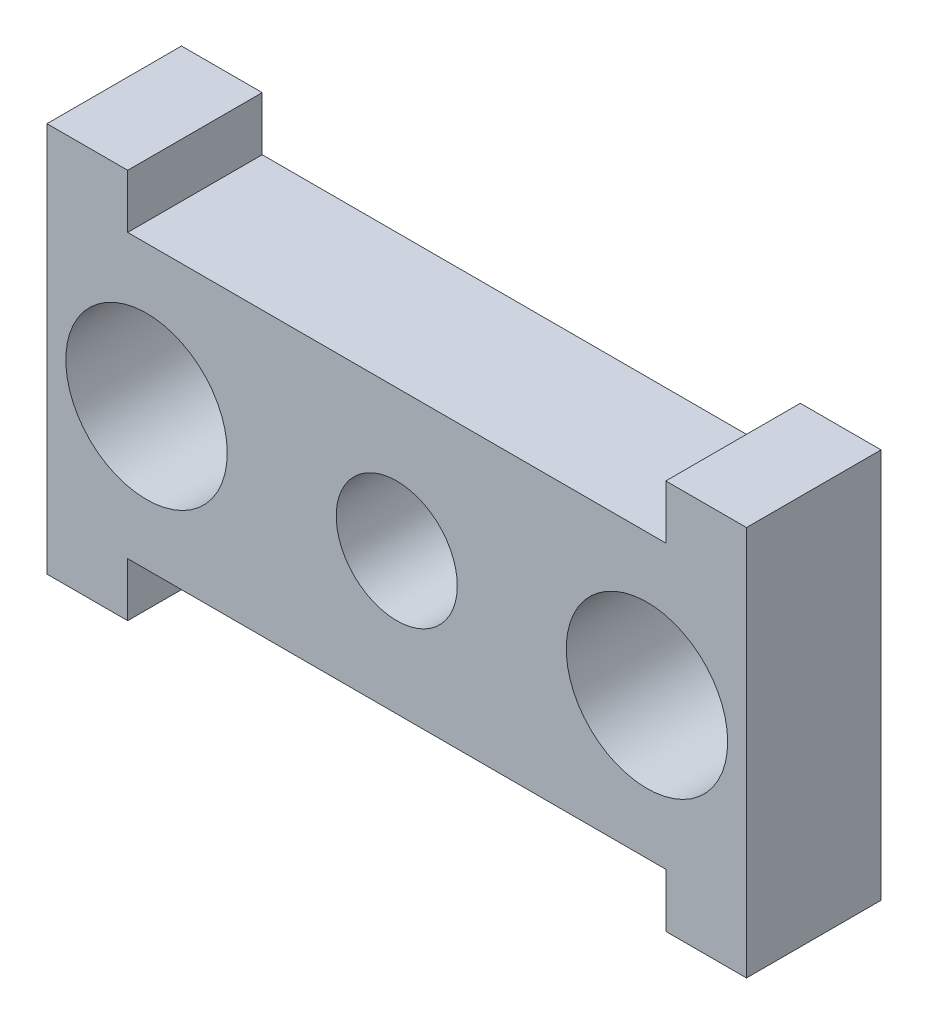
ISO-10303-21;
HEADER;
FILE_DESCRIPTION(('STEP AP214'),'2;1');
FILE_NAME('part.step','',(''),(''),'','','');
FILE_SCHEMA(('AUTOMOTIVE_DESIGN { 1 0 10303 214 1 1 1 1 }'));
ENDSEC;
DATA;
#1=APPLICATION_CONTEXT('core data for automotive mechanical design processes');
#2=APPLICATION_PROTOCOL_DEFINITION('international standard','automotive_design',2000,#1);
#3=PRODUCT_CONTEXT('',#1,'mechanical');
#4=PRODUCT('Part','Part','',(#3));
#5=PRODUCT_RELATED_PRODUCT_CATEGORY('part','',(#4));
#6=PRODUCT_DEFINITION_FORMATION('','',#4);
#7=PRODUCT_DEFINITION_CONTEXT('part definition',#1,'design');
#8=PRODUCT_DEFINITION('design','',#6,#7);
#9=PRODUCT_DEFINITION_SHAPE('','',#8);
#10=(LENGTH_UNIT() NAMED_UNIT(*) SI_UNIT(.MILLI.,.METRE.));
#11=(NAMED_UNIT(*) PLANE_ANGLE_UNIT() SI_UNIT($,.RADIAN.));
#12=(NAMED_UNIT(*) SI_UNIT($,.STERADIAN.) SOLID_ANGLE_UNIT());
#13=UNCERTAINTY_MEASURE_WITH_UNIT(LENGTH_MEASURE(1.E-05),#10,'distance_accuracy_value','');
#14=(GEOMETRIC_REPRESENTATION_CONTEXT(3) GLOBAL_UNCERTAINTY_ASSIGNED_CONTEXT((#13)) GLOBAL_UNIT_ASSIGNED_CONTEXT((#10,
#11,#12)) REPRESENTATION_CONTEXT('',''));
#15=CARTESIAN_POINT('',(0.,0.,0.));
#16=DIRECTION('',(0.,0.,1.));
#17=DIRECTION('',(1.,0.,0.));
#18=AXIS2_PLACEMENT_3D('',#15,#16,#17);
#19=CARTESIAN_POINT('',(-9.99999999999999,0.,5.));
#20=DIRECTION('',(-1.,0.,0.));
#21=DIRECTION('',(0.,-1.,0.));
#22=AXIS2_PLACEMENT_3D('',#19,#20,#21);
#23=PLANE('',#22);
#24=DIRECTION('',(0.,1.,0.));
#25=VECTOR('',#24,1.);
#26=CARTESIAN_POINT('',(-9.99999999999999,0.,0.));
#27=LINE('',#26,#25);
#28=CARTESIAN_POINT('',(-10.,-7.25000000000001,0.));
#29=VERTEX_POINT('',#28);
#30=CARTESIAN_POINT('',(-10.,-5.25,0.));
#31=VERTEX_POINT('',#30);
#32=EDGE_CURVE('E167',#29,#31,#27,.T.);
#33=ORIENTED_EDGE('',*,*,#32,.T.);
#34=DIRECTION('',(0.,0.,-1.));
#35=VECTOR('',#34,1.);
#36=CARTESIAN_POINT('',(-10.,-5.25,5.));
#37=LINE('',#36,#35);
#38=CARTESIAN_POINT('',(-10.,-5.25,5.));
#39=VERTEX_POINT('',#38);
#40=EDGE_CURVE('E11',#39,#31,#37,.T.);
#41=ORIENTED_EDGE('',*,*,#40,.F.);
#42=DIRECTION('',(0.,1.,0.));
#43=VECTOR('',#42,1.);
#44=CARTESIAN_POINT('',(-9.99999999999999,0.,5.));
#45=LINE('',#44,#43);
#46=CARTESIAN_POINT('',(-10.,-7.25000000000001,5.));
#47=VERTEX_POINT('',#46);
#48=EDGE_CURVE('E202',#47,#39,#45,.T.);
#49=ORIENTED_EDGE('',*,*,#48,.F.);
#50=DIRECTION('',(0.,0.,-1.));
#51=VECTOR('',#50,1.);
#52=CARTESIAN_POINT('',(-10.,-7.25000000000001,5.));
#53=LINE('',#52,#51);
#54=EDGE_CURVE('E166',#47,#29,#53,.T.);
#55=ORIENTED_EDGE('',*,*,#54,.T.);
#56=EDGE_LOOP('',(#33,#41,#49,#55));
#57=FACE_BOUND('',#56,.T.);
#58=ADVANCED_FACE('F35',(#57),#23,.F.);
#59=CARTESIAN_POINT('',(0.,-5.25,5.));
#60=DIRECTION('',(0.,1.,0.));
#61=DIRECTION('',(-1.,0.,0.));
#62=AXIS2_PLACEMENT_3D('',#59,#60,#61);
#63=PLANE('',#62);
#64=DIRECTION('',(1.,0.,0.));
#65=VECTOR('',#64,1.);
#66=CARTESIAN_POINT('',(0.,-5.25,0.));
#67=LINE('',#66,#65);
#68=CARTESIAN_POINT('',(10.,-5.25,0.));
#69=VERTEX_POINT('',#68);
#70=EDGE_CURVE('E170',#31,#69,#67,.T.);
#71=ORIENTED_EDGE('',*,*,#70,.T.);
#72=DIRECTION('',(0.,0.,-1.));
#73=VECTOR('',#72,1.);
#74=CARTESIAN_POINT('',(10.,-5.25,5.));
#75=LINE('',#74,#73);
#76=CARTESIAN_POINT('',(10.,-5.25,5.));
#77=VERTEX_POINT('',#76);
#78=EDGE_CURVE('E43',#77,#69,#75,.T.);
#79=ORIENTED_EDGE('',*,*,#78,.F.);
#80=DIRECTION('',(1.,0.,0.));
#81=VECTOR('',#80,1.);
#82=CARTESIAN_POINT('',(0.,-5.25,5.));
#83=LINE('',#82,#81);
#84=EDGE_CURVE('E102',#39,#77,#83,.T.);
#85=ORIENTED_EDGE('',*,*,#84,.F.);
#86=ORIENTED_EDGE('',*,*,#40,.T.);
#87=EDGE_LOOP('',(#71,#79,#85,#86));
#88=FACE_BOUND('',#87,.T.);
#89=ADVANCED_FACE('F275',(#88),#63,.F.);
#90=CARTESIAN_POINT('',(9.99999999999998,0.,5.));
#91=DIRECTION('',(1.,0.,0.));
#92=DIRECTION('',(0.,1.,0.));
#93=AXIS2_PLACEMENT_3D('',#90,#91,#92);
#94=PLANE('',#93);
#95=DIRECTION('',(0.,-1.,0.));
#96=VECTOR('',#95,1.);
#97=CARTESIAN_POINT('',(9.99999999999998,0.,0.));
#98=LINE('',#97,#96);
#99=CARTESIAN_POINT('',(10.,-7.25,0.));
#100=VERTEX_POINT('',#99);
#101=EDGE_CURVE('E172',#69,#100,#98,.T.);
#102=ORIENTED_EDGE('',*,*,#101,.T.);
#103=DIRECTION('',(0.,0.,-1.));
#104=VECTOR('',#103,1.);
#105=CARTESIAN_POINT('',(10.,-7.25,5.));
#106=LINE('',#105,#104);
#107=CARTESIAN_POINT('',(10.,-7.25,5.));
#108=VERTEX_POINT('',#107);
#109=EDGE_CURVE('E217',#108,#100,#106,.T.);
#110=ORIENTED_EDGE('',*,*,#109,.F.);
#111=DIRECTION('',(0.,-1.,0.));
#112=VECTOR('',#111,1.);
#113=CARTESIAN_POINT('',(9.99999999999998,0.,5.));
#114=LINE('',#113,#112);
#115=EDGE_CURVE('E225',#77,#108,#114,.T.);
#116=ORIENTED_EDGE('',*,*,#115,.F.);
#117=ORIENTED_EDGE('',*,*,#78,.T.);
#118=EDGE_LOOP('',(#102,#110,#116,#117));
#119=FACE_BOUND('',#118,.T.);
#120=ADVANCED_FACE('F223',(#119),#94,.F.);
#121=CARTESIAN_POINT('',(0.,-7.25,5.));
#122=DIRECTION('',(0.,1.,0.));
#123=DIRECTION('',(-1.,0.,0.));
#124=AXIS2_PLACEMENT_3D('',#121,#122,#123);
#125=PLANE('',#124);
#126=DIRECTION('',(1.,0.,0.));
#127=VECTOR('',#126,1.);
#128=CARTESIAN_POINT('',(0.,-7.25,0.));
#129=LINE('',#128,#127);
#130=CARTESIAN_POINT('',(13.,-7.25,0.));
#131=VERTEX_POINT('',#130);
#132=EDGE_CURVE('E174',#100,#131,#129,.T.);
#133=ORIENTED_EDGE('',*,*,#132,.T.);
#134=DIRECTION('',(0.,0.,-1.));
#135=VECTOR('',#134,1.);
#136=CARTESIAN_POINT('',(13.,-7.25,5.));
#137=LINE('',#136,#135);
#138=CARTESIAN_POINT('',(13.,-7.25,5.));
#139=VERTEX_POINT('',#138);
#140=EDGE_CURVE('E214',#139,#131,#137,.T.);
#141=ORIENTED_EDGE('',*,*,#140,.F.);
#142=DIRECTION('',(1.,0.,0.));
#143=VECTOR('',#142,1.);
#144=CARTESIAN_POINT('',(0.,-7.25,5.));
#145=LINE('',#144,#143);
#146=EDGE_CURVE('E154',#108,#139,#145,.T.);
#147=ORIENTED_EDGE('',*,*,#146,.F.);
#148=ORIENTED_EDGE('',*,*,#109,.T.);
#149=EDGE_LOOP('',(#133,#141,#147,#148));
#150=FACE_BOUND('',#149,.T.);
#151=ADVANCED_FACE('F234',(#150),#125,.F.);
#152=CARTESIAN_POINT('',(13.,0.,5.));
#153=DIRECTION('',(-1.,0.,0.));
#154=DIRECTION('',(0.,-1.,0.));
#155=AXIS2_PLACEMENT_3D('',#152,#153,#154);
#156=PLANE('',#155);
#157=DIRECTION('',(0.,1.,0.));
#158=VECTOR('',#157,1.);
#159=CARTESIAN_POINT('',(13.,0.,0.));
#160=LINE('',#159,#158);
#161=CARTESIAN_POINT('',(13.,7.25000000000001,0.));
#162=VERTEX_POINT('',#161);
#163=EDGE_CURVE('E176',#131,#162,#160,.T.);
#164=ORIENTED_EDGE('',*,*,#163,.T.);
#165=DIRECTION('',(0.,0.,-1.));
#166=VECTOR('',#165,1.);
#167=CARTESIAN_POINT('',(13.,7.25000000000001,5.));
#168=LINE('',#167,#166);
#169=CARTESIAN_POINT('',(13.,7.25000000000001,5.));
#170=VERTEX_POINT('',#169);
#171=EDGE_CURVE('E212',#170,#162,#168,.T.);
#172=ORIENTED_EDGE('',*,*,#171,.F.);
#173=DIRECTION('',(0.,1.,0.));
#174=VECTOR('',#173,1.);
#175=CARTESIAN_POINT('',(13.,0.,5.));
#176=LINE('',#175,#174);
#177=EDGE_CURVE('E240',#139,#170,#176,.T.);
#178=ORIENTED_EDGE('',*,*,#177,.F.);
#179=ORIENTED_EDGE('',*,*,#140,.T.);
#180=EDGE_LOOP('',(#164,#172,#178,#179));
#181=FACE_BOUND('',#180,.T.);
#182=ADVANCED_FACE('F238',(#181),#156,.F.);
#183=CARTESIAN_POINT('',(0.,7.25,5.));
#184=DIRECTION('',(0.,1.,0.));
#185=DIRECTION('',(-1.,0.,0.));
#186=AXIS2_PLACEMENT_3D('',#183,#184,#185);
#187=PLANE('',#186);
#188=DIRECTION('',(1.,0.,0.));
#189=VECTOR('',#188,1.);
#190=CARTESIAN_POINT('',(0.,7.25,0.));
#191=LINE('',#190,#189);
#192=CARTESIAN_POINT('',(10.,7.25000000000001,0.));
#193=VERTEX_POINT('',#192);
#194=EDGE_CURVE('E179',#193,#162,#191,.T.);
#195=ORIENTED_EDGE('',*,*,#194,.F.);
#196=DIRECTION('',(0.,0.,-1.));
#197=VECTOR('',#196,1.);
#198=CARTESIAN_POINT('',(10.,7.25000000000001,5.));
#199=LINE('',#198,#197);
#200=CARTESIAN_POINT('',(10.,7.25000000000001,5.));
#201=VERTEX_POINT('',#200);
#202=EDGE_CURVE('E210',#201,#193,#199,.T.);
#203=ORIENTED_EDGE('',*,*,#202,.F.);
#204=DIRECTION('',(1.,0.,0.));
#205=VECTOR('',#204,1.);
#206=CARTESIAN_POINT('',(0.,7.25,5.));
#207=LINE('',#206,#205);
#208=EDGE_CURVE('E149',#201,#170,#207,.T.);
#209=ORIENTED_EDGE('',*,*,#208,.T.);
#210=ORIENTED_EDGE('',*,*,#171,.T.);
#211=EDGE_LOOP('',(#195,#203,#209,#210));
#212=FACE_BOUND('',#211,.T.);
#213=ADVANCED_FACE('F286',(#212),#187,.T.);
#214=CARTESIAN_POINT('',(10.,0.,5.));
#215=DIRECTION('',(-1.,0.,0.));
#216=DIRECTION('',(0.,0.,1.));
#217=AXIS2_PLACEMENT_3D('',#214,#215,#216);
#218=PLANE('',#217);
#219=DIRECTION('',(0.,1.,0.));
#220=VECTOR('',#219,1.);
#221=CARTESIAN_POINT('',(10.,0.,0.));
#222=LINE('',#221,#220);
#223=CARTESIAN_POINT('',(10.,5.25,0.));
#224=VERTEX_POINT('',#223);
#225=EDGE_CURVE('E182',#224,#193,#222,.T.);
#226=ORIENTED_EDGE('',*,*,#225,.F.);
#227=DIRECTION('',(0.,0.,-1.));
#228=VECTOR('',#227,1.);
#229=CARTESIAN_POINT('',(10.,5.25,5.));
#230=LINE('',#229,#228);
#231=CARTESIAN_POINT('',(10.,5.25,5.));
#232=VERTEX_POINT('',#231);
#233=EDGE_CURVE('E208',#232,#224,#230,.T.);
#234=ORIENTED_EDGE('',*,*,#233,.F.);
#235=DIRECTION('',(0.,1.,0.));
#236=VECTOR('',#235,1.);
#237=CARTESIAN_POINT('',(10.,0.,5.));
#238=LINE('',#237,#236);
#239=EDGE_CURVE('E244',#232,#201,#238,.T.);
#240=ORIENTED_EDGE('',*,*,#239,.T.);
#241=ORIENTED_EDGE('',*,*,#202,.T.);
#242=EDGE_LOOP('',(#226,#234,#240,#241));
#243=FACE_BOUND('',#242,.T.);
#244=ADVANCED_FACE('F287',(#243),#218,.T.);
#245=CARTESIAN_POINT('',(0.,5.25,5.));
#246=DIRECTION('',(0.,1.,0.));
#247=DIRECTION('',(-1.,0.,0.));
#248=AXIS2_PLACEMENT_3D('',#245,#246,#247);
#249=PLANE('',#248);
#250=DIRECTION('',(1.,0.,0.));
#251=VECTOR('',#250,1.);
#252=CARTESIAN_POINT('',(0.,5.25,0.));
#253=LINE('',#252,#251);
#254=CARTESIAN_POINT('',(-10.,5.25,0.));
#255=VERTEX_POINT('',#254);
#256=EDGE_CURVE('E185',#255,#224,#253,.T.);
#257=ORIENTED_EDGE('',*,*,#256,.F.);
#258=DIRECTION('',(0.,0.,-1.));
#259=VECTOR('',#258,1.);
#260=CARTESIAN_POINT('',(-10.,5.25,5.));
#261=LINE('',#260,#259);
#262=CARTESIAN_POINT('',(-10.,5.25,5.));
#263=VERTEX_POINT('',#262);
#264=EDGE_CURVE('E206',#263,#255,#261,.T.);
#265=ORIENTED_EDGE('',*,*,#264,.F.);
#266=DIRECTION('',(1.,0.,0.));
#267=VECTOR('',#266,1.);
#268=CARTESIAN_POINT('',(0.,5.25,5.));
#269=LINE('',#268,#267);
#270=EDGE_CURVE('E248',#263,#232,#269,.T.);
#271=ORIENTED_EDGE('',*,*,#270,.T.);
#272=ORIENTED_EDGE('',*,*,#233,.T.);
#273=EDGE_LOOP('',(#257,#265,#271,#272));
#274=FACE_BOUND('',#273,.T.);
#275=ADVANCED_FACE('F290',(#274),#249,.T.);
#276=CARTESIAN_POINT('',(-9.99999999999999,0.,5.));
#277=DIRECTION('',(1.,0.,0.));
#278=DIRECTION('',(0.,1.,0.));
#279=AXIS2_PLACEMENT_3D('',#276,#277,#278);
#280=PLANE('',#279);
#281=DIRECTION('',(0.,-1.,0.));
#282=VECTOR('',#281,1.);
#283=CARTESIAN_POINT('',(-9.99999999999999,0.,0.));
#284=LINE('',#283,#282);
#285=CARTESIAN_POINT('',(-10.,7.25,0.));
#286=VERTEX_POINT('',#285);
#287=EDGE_CURVE('E188',#286,#255,#284,.T.);
#288=ORIENTED_EDGE('',*,*,#287,.F.);
#289=DIRECTION('',(0.,0.,-1.));
#290=VECTOR('',#289,1.);
#291=CARTESIAN_POINT('',(-10.,7.25,5.));
#292=LINE('',#291,#290);
#293=CARTESIAN_POINT('',(-10.,7.25,5.));
#294=VERTEX_POINT('',#293);
#295=EDGE_CURVE('E139',#294,#286,#292,.T.);
#296=ORIENTED_EDGE('',*,*,#295,.F.);
#297=DIRECTION('',(0.,-1.,0.));
#298=VECTOR('',#297,1.);
#299=CARTESIAN_POINT('',(-9.99999999999999,0.,5.));
#300=LINE('',#299,#298);
#301=EDGE_CURVE('E147',#294,#263,#300,.T.);
#302=ORIENTED_EDGE('',*,*,#301,.T.);
#303=ORIENTED_EDGE('',*,*,#264,.T.);
#304=EDGE_LOOP('',(#288,#296,#302,#303));
#305=FACE_BOUND('',#304,.T.);
#306=ADVANCED_FACE('F253',(#305),#280,.T.);
#307=CARTESIAN_POINT('',(-13.,7.25,0.));
#308=VERTEX_POINT('',#307);
#309=EDGE_CURVE('E134',#308,#286,#191,.T.);
#310=ORIENTED_EDGE('',*,*,#309,.F.);
#311=DIRECTION('',(0.,0.,-1.));
#312=VECTOR('',#311,1.);
#313=CARTESIAN_POINT('',(-13.,7.25,5.));
#314=LINE('',#313,#312);
#315=CARTESIAN_POINT('',(-13.,7.25,5.));
#316=VERTEX_POINT('',#315);
#317=EDGE_CURVE('E129',#316,#308,#314,.T.);
#318=ORIENTED_EDGE('',*,*,#317,.F.);
#319=EDGE_CURVE('E132',#316,#294,#207,.T.);
#320=ORIENTED_EDGE('',*,*,#319,.T.);
#321=ORIENTED_EDGE('',*,*,#295,.T.);
#322=EDGE_LOOP('',(#310,#318,#320,#321));
#323=FACE_BOUND('',#322,.T.);
#324=ADVANCED_FACE('F131',(#323),#187,.T.);
#325=CARTESIAN_POINT('',(-13.,0.,5.));
#326=DIRECTION('',(-1.,0.,0.));
#327=DIRECTION('',(0.,0.,1.));
#328=AXIS2_PLACEMENT_3D('',#325,#326,#327);
#329=PLANE('',#328);
#330=DIRECTION('',(0.,1.,0.));
#331=VECTOR('',#330,1.);
#332=CARTESIAN_POINT('',(-13.,0.,0.));
#333=LINE('',#332,#331);
#334=CARTESIAN_POINT('',(-13.,-7.25000000000001,0.));
#335=VERTEX_POINT('',#334);
#336=EDGE_CURVE('E191',#335,#308,#333,.T.);
#337=ORIENTED_EDGE('',*,*,#336,.F.);
#338=DIRECTION('',(0.,0.,-1.));
#339=VECTOR('',#338,1.);
#340=CARTESIAN_POINT('',(-13.,-7.25000000000001,5.));
#341=LINE('',#340,#339);
#342=CARTESIAN_POINT('',(-13.,-7.25000000000001,5.));
#343=VERTEX_POINT('',#342);
#344=EDGE_CURVE('E91',#343,#335,#341,.T.);
#345=ORIENTED_EDGE('',*,*,#344,.F.);
#346=DIRECTION('',(0.,1.,0.));
#347=VECTOR('',#346,1.);
#348=CARTESIAN_POINT('',(-13.,0.,5.));
#349=LINE('',#348,#347);
#350=EDGE_CURVE('E144',#343,#316,#349,.T.);
#351=ORIENTED_EDGE('',*,*,#350,.T.);
#352=ORIENTED_EDGE('',*,*,#317,.T.);
#353=EDGE_LOOP('',(#337,#345,#351,#352));
#354=FACE_BOUND('',#353,.T.);
#355=ADVANCED_FACE('F150',(#354),#329,.T.);
#356=CARTESIAN_POINT('',(9.3,0.,5.));
#357=DIRECTION('',(0.,0.,-1.));
#358=DIRECTION('',(-1.,0.,0.));
#359=AXIS2_PLACEMENT_3D('',#356,#357,#358);
#360=CYLINDRICAL_SURFACE('',#359,3.);
#361=CARTESIAN_POINT('',(9.3,0.,5.));
#362=DIRECTION('',(0.,0.,1.));
#363=DIRECTION('',(1.,0.,0.));
#364=AXIS2_PLACEMENT_3D('',#361,#362,#363);
#365=CIRCLE('',#364,3.);
#366=CARTESIAN_POINT('',(12.3,0.,5.));
#367=VERTEX_POINT('',#366);
#368=EDGE_CURVE('E160',#367,#367,#365,.T.);
#369=ORIENTED_EDGE('',*,*,#368,.T.);
#370=EDGE_LOOP('',(#369));
#371=FACE_BOUND('',#370,.T.);
#372=CARTESIAN_POINT('',(9.3,0.,0.));
#373=DIRECTION('',(0.,0.,1.));
#374=DIRECTION('',(1.,0.,0.));
#375=AXIS2_PLACEMENT_3D('',#372,#373,#374);
#376=CIRCLE('',#375,3.);
#377=CARTESIAN_POINT('',(12.3,0.,0.));
#378=VERTEX_POINT('',#377);
#379=EDGE_CURVE('E196',#378,#378,#376,.T.);
#380=ORIENTED_EDGE('',*,*,#379,.F.);
#381=EDGE_LOOP('',(#380));
#382=FACE_BOUND('',#381,.T.);
#383=ADVANCED_FACE('F269',(#371,#382),#360,.F.);
#384=CARTESIAN_POINT('',(0.,0.,5.));
#385=DIRECTION('',(0.,0.,-1.));
#386=DIRECTION('',(-1.,0.,0.));
#387=AXIS2_PLACEMENT_3D('',#384,#385,#386);
#388=CYLINDRICAL_SURFACE('',#387,2.25);
#389=CARTESIAN_POINT('',(0.,0.,5.));
#390=DIRECTION('',(0.,0.,1.));
#391=DIRECTION('',(1.,0.,0.));
#392=AXIS2_PLACEMENT_3D('',#389,#390,#391);
#393=CIRCLE('',#392,2.25);
#394=CARTESIAN_POINT('',(2.25,0.,5.));
#395=VERTEX_POINT('',#394);
#396=EDGE_CURVE('E152',#395,#395,#393,.T.);
#397=ORIENTED_EDGE('',*,*,#396,.T.);
#398=EDGE_LOOP('',(#397));
#399=FACE_BOUND('',#398,.T.);
#400=CARTESIAN_POINT('',(0.,0.,0.));
#401=DIRECTION('',(0.,0.,1.));
#402=DIRECTION('',(1.,0.,0.));
#403=AXIS2_PLACEMENT_3D('',#400,#401,#402);
#404=CIRCLE('',#403,2.25);
#405=CARTESIAN_POINT('',(2.25,0.,0.));
#406=VERTEX_POINT('',#405);
#407=EDGE_CURVE('E193',#406,#406,#404,.T.);
#408=ORIENTED_EDGE('',*,*,#407,.F.);
#409=EDGE_LOOP('',(#408));
#410=FACE_BOUND('',#409,.T.);
#411=ADVANCED_FACE('F261',(#399,#410),#388,.F.);
#412=EDGE_CURVE('E94',#335,#29,#129,.T.);
#413=ORIENTED_EDGE('',*,*,#412,.T.);
#414=ORIENTED_EDGE('',*,*,#54,.F.);
#415=EDGE_CURVE('E51',#343,#47,#145,.T.);
#416=ORIENTED_EDGE('',*,*,#415,.F.);
#417=ORIENTED_EDGE('',*,*,#344,.T.);
#418=EDGE_LOOP('',(#413,#414,#416,#417));
#419=FACE_BOUND('',#418,.T.);
#420=ADVANCED_FACE('F258',(#419),#125,.F.);
#421=CARTESIAN_POINT('',(-9.3,-1.0325074129014E-13,5.));
#422=DIRECTION('',(0.,0.,-1.));
#423=DIRECTION('',(-1.,0.,0.));
#424=AXIS2_PLACEMENT_3D('',#421,#422,#423);
#425=CYLINDRICAL_SURFACE('',#424,3.);
#426=CARTESIAN_POINT('',(-9.3,-1.0325074129014E-13,5.));
#427=DIRECTION('',(0.,0.,1.));
#428=DIRECTION('',(1.,0.,0.));
#429=AXIS2_PLACEMENT_3D('',#426,#427,#428);
#430=CIRCLE('',#429,3.);
#431=CARTESIAN_POINT('',(-6.3,-1.0325074129014E-13,5.));
#432=VERTEX_POINT('',#431);
#433=EDGE_CURVE('E163',#432,#432,#430,.F.);
#434=ORIENTED_EDGE('',*,*,#433,.F.);
#435=EDGE_LOOP('',(#434));
#436=FACE_BOUND('',#435,.T.);
#437=CARTESIAN_POINT('',(-9.3,-1.0325074129014E-13,0.));
#438=DIRECTION('',(0.,0.,1.));
#439=DIRECTION('',(1.,0.,0.));
#440=AXIS2_PLACEMENT_3D('',#437,#438,#439);
#441=CIRCLE('',#440,3.);
#442=CARTESIAN_POINT('',(-6.3,-1.0325074129014E-13,0.));
#443=VERTEX_POINT('',#442);
#444=EDGE_CURVE('E199',#443,#443,#441,.F.);
#445=ORIENTED_EDGE('',*,*,#444,.T.);
#446=EDGE_LOOP('',(#445));
#447=FACE_BOUND('',#446,.T.);
#448=ADVANCED_FACE('F260',(#436,#447),#425,.F.);
#449=CARTESIAN_POINT('',(0.,0.,5.));
#450=DIRECTION('',(0.,0.,1.));
#451=DIRECTION('',(1.,0.,0.));
#452=AXIS2_PLACEMENT_3D('',#449,#450,#451);
#453=PLANE('',#452);
#454=ORIENTED_EDGE('',*,*,#48,.T.);
#455=ORIENTED_EDGE('',*,*,#84,.T.);
#456=ORIENTED_EDGE('',*,*,#115,.T.);
#457=ORIENTED_EDGE('',*,*,#146,.T.);
#458=ORIENTED_EDGE('',*,*,#177,.T.);
#459=ORIENTED_EDGE('',*,*,#208,.F.);
#460=ORIENTED_EDGE('',*,*,#239,.F.);
#461=ORIENTED_EDGE('',*,*,#270,.F.);
#462=ORIENTED_EDGE('',*,*,#301,.F.);
#463=ORIENTED_EDGE('',*,*,#319,.F.);
#464=ORIENTED_EDGE('',*,*,#350,.F.);
#465=ORIENTED_EDGE('',*,*,#415,.T.);
#466=EDGE_LOOP('',(#454,#455,#456,#457,#458,#459,#460,#461,#462,#463,#464,#465));
#467=FACE_BOUND('',#466,.T.);
#468=ORIENTED_EDGE('',*,*,#396,.F.);
#469=EDGE_LOOP('',(#468));
#470=FACE_BOUND('',#469,.T.);
#471=ORIENTED_EDGE('',*,*,#368,.F.);
#472=EDGE_LOOP('',(#471));
#473=FACE_BOUND('',#472,.T.);
#474=ORIENTED_EDGE('',*,*,#433,.T.);
#475=EDGE_LOOP('',(#474));
#476=FACE_BOUND('',#475,.T.);
#477=ADVANCED_FACE('F142',(#467,#470,#473,#476),#453,.T.);
#478=CARTESIAN_POINT('',(0.,0.,0.));
#479=DIRECTION('',(0.,0.,1.));
#480=DIRECTION('',(1.,0.,0.));
#481=AXIS2_PLACEMENT_3D('',#478,#479,#480);
#482=PLANE('',#481);
#483=ORIENTED_EDGE('',*,*,#32,.F.);
#484=ORIENTED_EDGE('',*,*,#412,.F.);
#485=ORIENTED_EDGE('',*,*,#336,.T.);
#486=ORIENTED_EDGE('',*,*,#309,.T.);
#487=ORIENTED_EDGE('',*,*,#287,.T.);
#488=ORIENTED_EDGE('',*,*,#256,.T.);
#489=ORIENTED_EDGE('',*,*,#225,.T.);
#490=ORIENTED_EDGE('',*,*,#194,.T.);
#491=ORIENTED_EDGE('',*,*,#163,.F.);
#492=ORIENTED_EDGE('',*,*,#132,.F.);
#493=ORIENTED_EDGE('',*,*,#101,.F.);
#494=ORIENTED_EDGE('',*,*,#70,.F.);
#495=EDGE_LOOP('',(#483,#484,#485,#486,#487,#488,#489,#490,#491,#492,#493,#494));
#496=FACE_BOUND('',#495,.T.);
#497=ORIENTED_EDGE('',*,*,#407,.T.);
#498=EDGE_LOOP('',(#497));
#499=FACE_BOUND('',#498,.T.);
#500=ORIENTED_EDGE('',*,*,#379,.T.);
#501=EDGE_LOOP('',(#500));
#502=FACE_BOUND('',#501,.T.);
#503=ORIENTED_EDGE('',*,*,#444,.F.);
#504=EDGE_LOOP('',(#503));
#505=FACE_BOUND('',#504,.T.);
#506=ADVANCED_FACE('F229',(#496,#499,#502,#505),#482,.F.);
#507=CLOSED_SHELL('',(#58,#89,#120,#151,#182,#213,#244,#275,#306,#324,#355,#383,#411,#420,#448,
#477,#506));
#508=MANIFOLD_SOLID_BREP('B2',#507);
#509=ADVANCED_BREP_SHAPE_REPRESENTATION('',(#18,#508),#14);
#510=SHAPE_DEFINITION_REPRESENTATION(#9,#509);
ENDSEC;
END-ISO-10303-21;
